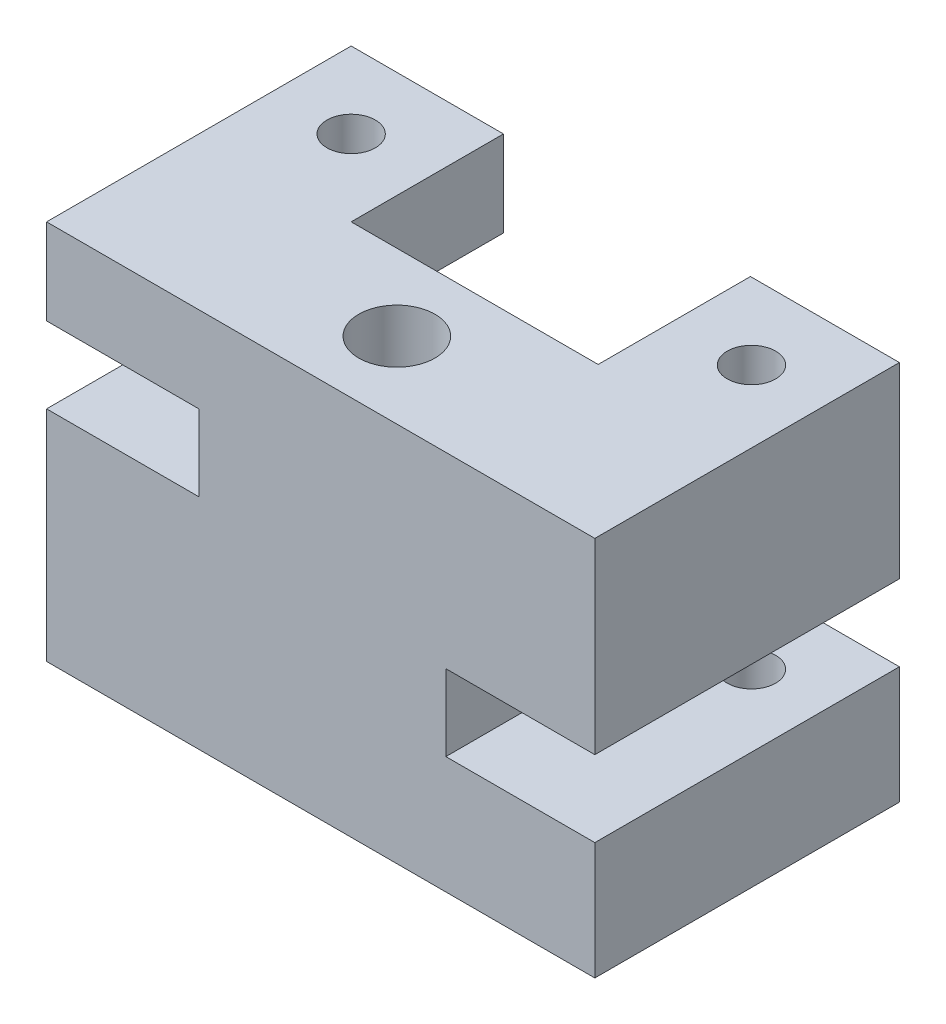
ISO-10303-21;
HEADER;
FILE_DESCRIPTION(('STEP AP214'),'2;1');
FILE_NAME('part.step','',(''),(''),'','','');
FILE_SCHEMA(('AUTOMOTIVE_DESIGN { 1 0 10303 214 1 1 1 1 }'));
ENDSEC;
DATA;
#1=APPLICATION_CONTEXT('core data for automotive mechanical design processes');
#2=APPLICATION_PROTOCOL_DEFINITION('international standard','automotive_design',2000,#1);
#3=PRODUCT_CONTEXT('',#1,'mechanical');
#4=PRODUCT('Part','Part','',(#3));
#5=PRODUCT_RELATED_PRODUCT_CATEGORY('part','',(#4));
#6=PRODUCT_DEFINITION_FORMATION('','',#4);
#7=PRODUCT_DEFINITION_CONTEXT('part definition',#1,'design');
#8=PRODUCT_DEFINITION('design','',#6,#7);
#9=PRODUCT_DEFINITION_SHAPE('','',#8);
#10=(LENGTH_UNIT() NAMED_UNIT(*) SI_UNIT(.MILLI.,.METRE.));
#11=(NAMED_UNIT(*) PLANE_ANGLE_UNIT() SI_UNIT($,.RADIAN.));
#12=(NAMED_UNIT(*) SI_UNIT($,.STERADIAN.) SOLID_ANGLE_UNIT());
#13=UNCERTAINTY_MEASURE_WITH_UNIT(LENGTH_MEASURE(1.E-05),#10,'distance_accuracy_value','');
#14=(GEOMETRIC_REPRESENTATION_CONTEXT(3) GLOBAL_UNCERTAINTY_ASSIGNED_CONTEXT((#13)) GLOBAL_UNIT_ASSIGNED_CONTEXT((#10,
#11,#12)) REPRESENTATION_CONTEXT('',''));
#15=CARTESIAN_POINT('',(0.,0.,0.));
#16=DIRECTION('',(0.,0.,1.));
#17=DIRECTION('',(1.,0.,0.));
#18=AXIS2_PLACEMENT_3D('',#15,#16,#17);
#19=CARTESIAN_POINT('',(0.,0.,0.));
#20=DIRECTION('',(0.,0.,-1.));
#21=DIRECTION('',(-1.,0.,0.));
#22=AXIS2_PLACEMENT_3D('',#19,#20,#21);
#23=PLANE('',#22);
#24=DIRECTION('',(0.,-1.,0.));
#25=VECTOR('',#24,1.);
#26=CARTESIAN_POINT('',(-24.,2.5,0.));
#27=LINE('',#26,#25);
#28=CARTESIAN_POINT('',(-24.,17.5,0.));
#29=VERTEX_POINT('',#28);
#30=CARTESIAN_POINT('',(-24.,2.5,0.));
#31=VERTEX_POINT('',#30);
#32=EDGE_CURVE('E157',#29,#31,#27,.T.);
#33=ORIENTED_EDGE('',*,*,#32,.F.);
#34=DIRECTION('',(0.,-1.,0.));
#35=VECTOR('',#34,1.);
#36=CARTESIAN_POINT('',(-24.,17.5,0.));
#37=LINE('',#36,#35);
#38=CARTESIAN_POINT('',(-24.,34.4017176177199,0.));
#39=VERTEX_POINT('',#38);
#40=EDGE_CURVE('E220',#39,#29,#37,.T.);
#41=ORIENTED_EDGE('',*,*,#40,.F.);
#42=DIRECTION('',(-1.,0.,0.));
#43=VECTOR('',#42,1.);
#44=CARTESIAN_POINT('',(-54.,34.4017176177199,0.));
#45=LINE('',#44,#43);
#46=CARTESIAN_POINT('',(24.6546989048147,34.4017176177199,0.));
#47=VERTEX_POINT('',#46);
#48=EDGE_CURVE('E169',#47,#39,#45,.T.);
#49=ORIENTED_EDGE('',*,*,#48,.F.);
#50=DIRECTION('',(0.,1.,0.));
#51=VECTOR('',#50,1.);
#52=CARTESIAN_POINT('',(24.6546989048147,34.4017176177199,0.));
#53=LINE('',#52,#51);
#54=CARTESIAN_POINT('',(24.6546989048147,-2.5,0.));
#55=VERTEX_POINT('',#54);
#56=EDGE_CURVE('E84',#55,#47,#53,.T.);
#57=ORIENTED_EDGE('',*,*,#56,.F.);
#58=DIRECTION('',(0.,1.,0.));
#59=VECTOR('',#58,1.);
#60=CARTESIAN_POINT('',(24.6546989048147,-2.5,0.));
#61=LINE('',#60,#59);
#62=CARTESIAN_POINT('',(24.6546989048147,-17.5,0.));
#63=VERTEX_POINT('',#62);
#64=EDGE_CURVE('E166',#63,#55,#61,.T.);
#65=ORIENTED_EDGE('',*,*,#64,.F.);
#66=DIRECTION('',(0.,1.,0.));
#67=VECTOR('',#66,1.);
#68=CARTESIAN_POINT('',(24.6546989048147,-17.5,0.));
#69=LINE('',#68,#67);
#70=CARTESIAN_POINT('',(24.6546989048147,-40.5982823822801,0.));
#71=VERTEX_POINT('',#70);
#72=EDGE_CURVE('E248',#71,#63,#69,.T.);
#73=ORIENTED_EDGE('',*,*,#72,.F.);
#74=DIRECTION('',(1.,0.,0.));
#75=VECTOR('',#74,1.);
#76=CARTESIAN_POINT('',(54.,-40.5982823822801,0.));
#77=LINE('',#76,#75);
#78=CARTESIAN_POINT('',(-24.,-40.5982823822801,0.));
#79=VERTEX_POINT('',#78);
#80=EDGE_CURVE('E161',#79,#71,#77,.T.);
#81=ORIENTED_EDGE('',*,*,#80,.F.);
#82=DIRECTION('',(0.,-1.,0.));
#83=VECTOR('',#82,1.);
#84=CARTESIAN_POINT('',(-24.,2.5,0.));
#85=LINE('',#84,#83);
#86=EDGE_CURVE('E59',#31,#79,#85,.T.);
#87=ORIENTED_EDGE('',*,*,#86,.F.);
#88=EDGE_LOOP('',(#33,#41,#49,#57,#65,#73,#81,#87));
#89=FACE_BOUND('',#88,.T.);
#90=ADVANCED_FACE('F43',(#89),#23,.T.);
#91=CARTESIAN_POINT('',(-54.,17.5,30.));
#92=DIRECTION('',(1.,0.,0.));
#93=DIRECTION('',(0.,0.,-1.));
#94=AXIS2_PLACEMENT_3D('',#91,#92,#93);
#95=PLANE('',#94);
#96=DIRECTION('',(0.,0.,-1.));
#97=VECTOR('',#96,1.);
#98=CARTESIAN_POINT('',(-54.,34.4017176177199,30.));
#99=LINE('',#98,#97);
#100=CARTESIAN_POINT('',(-54.,34.4017176177199,30.));
#101=VERTEX_POINT('',#100);
#102=CARTESIAN_POINT('',(-54.,34.4017176177199,-30.));
#103=VERTEX_POINT('',#102);
#104=EDGE_CURVE('E153',#101,#103,#99,.T.);
#105=ORIENTED_EDGE('',*,*,#104,.T.);
#106=DIRECTION('',(0.,1.,0.));
#107=VECTOR('',#106,1.);
#108=CARTESIAN_POINT('',(-54.,17.5,-30.));
#109=LINE('',#108,#107);
#110=CARTESIAN_POINT('',(-54.,17.5,-30.));
#111=VERTEX_POINT('',#110);
#112=EDGE_CURVE('E344',#111,#103,#109,.T.);
#113=ORIENTED_EDGE('',*,*,#112,.F.);
#114=DIRECTION('',(0.,0.,-1.));
#115=VECTOR('',#114,1.);
#116=CARTESIAN_POINT('',(-54.,17.5,30.));
#117=LINE('',#116,#115);
#118=CARTESIAN_POINT('',(-54.,17.5,30.));
#119=VERTEX_POINT('',#118);
#120=EDGE_CURVE('E13',#119,#111,#117,.T.);
#121=ORIENTED_EDGE('',*,*,#120,.F.);
#122=DIRECTION('',(0.,-1.,0.));
#123=VECTOR('',#122,1.);
#124=CARTESIAN_POINT('',(-54.,17.5,30.));
#125=LINE('',#124,#123);
#126=EDGE_CURVE('E173',#101,#119,#125,.T.);
#127=ORIENTED_EDGE('',*,*,#126,.F.);
#128=EDGE_LOOP('',(#105,#113,#121,#127));
#129=FACE_BOUND('',#128,.T.);
#130=ADVANCED_FACE('F45',(#129),#95,.F.);
#131=CARTESIAN_POINT('',(-24.,17.5,30.));
#132=DIRECTION('',(0.,1.,0.));
#133=DIRECTION('',(0.,0.,1.));
#134=AXIS2_PLACEMENT_3D('',#131,#132,#133);
#135=PLANE('',#134);
#136=CARTESIAN_POINT('',(-39.,17.5,-15.));
#137=DIRECTION('',(0.,1.,0.));
#138=DIRECTION('',(0.,0.,1.));
#139=AXIS2_PLACEMENT_3D('',#136,#137,#138);
#140=CIRCLE('',#139,4.7625);
#141=CARTESIAN_POINT('',(-39.,17.5,-10.2375));
#142=VERTEX_POINT('',#141);
#143=EDGE_CURVE('E375',#142,#142,#140,.T.);
#144=ORIENTED_EDGE('',*,*,#143,.T.);
#145=EDGE_LOOP('',(#144));
#146=FACE_BOUND('',#145,.T.);
#147=ORIENTED_EDGE('',*,*,#120,.T.);
#148=DIRECTION('',(-1.,0.,0.));
#149=VECTOR('',#148,1.);
#150=CARTESIAN_POINT('',(-54.,17.5,-30.));
#151=LINE('',#150,#149);
#152=CARTESIAN_POINT('',(-24.,17.5,-30.));
#153=VERTEX_POINT('',#152);
#154=EDGE_CURVE('E341',#153,#111,#151,.T.);
#155=ORIENTED_EDGE('',*,*,#154,.F.);
#156=DIRECTION('',(0.,0.,1.));
#157=VECTOR('',#156,1.);
#158=CARTESIAN_POINT('',(-24.,17.5,-30.));
#159=LINE('',#158,#157);
#160=EDGE_CURVE('E236',#153,#29,#159,.T.);
#161=ORIENTED_EDGE('',*,*,#160,.T.);
#162=DIRECTION('',(0.,0.,-1.));
#163=VECTOR('',#162,1.);
#164=CARTESIAN_POINT('',(-24.,17.5,30.));
#165=LINE('',#164,#163);
#166=CARTESIAN_POINT('',(-24.,17.5,30.));
#167=VERTEX_POINT('',#166);
#168=EDGE_CURVE('E52',#167,#29,#165,.T.);
#169=ORIENTED_EDGE('',*,*,#168,.F.);
#170=DIRECTION('',(1.,0.,0.));
#171=VECTOR('',#170,1.);
#172=CARTESIAN_POINT('',(-24.,17.5,30.));
#173=LINE('',#172,#171);
#174=EDGE_CURVE('E92',#119,#167,#173,.T.);
#175=ORIENTED_EDGE('',*,*,#174,.F.);
#176=EDGE_LOOP('',(#147,#155,#161,#169,#175));
#177=FACE_BOUND('',#176,.T.);
#178=ADVANCED_FACE('F484',(#146,#177),#135,.F.);
#179=CARTESIAN_POINT('',(-24.,2.5,30.));
#180=DIRECTION('',(1.,0.,0.));
#181=DIRECTION('',(0.,1.,0.));
#182=AXIS2_PLACEMENT_3D('',#179,#180,#181);
#183=PLANE('',#182);
#184=ORIENTED_EDGE('',*,*,#32,.T.);
#185=DIRECTION('',(0.,0.,-1.));
#186=VECTOR('',#185,1.);
#187=CARTESIAN_POINT('',(-24.,2.5,30.));
#188=LINE('',#187,#186);
#189=CARTESIAN_POINT('',(-24.,2.5,30.));
#190=VERTEX_POINT('',#189);
#191=EDGE_CURVE('E201',#190,#31,#188,.T.);
#192=ORIENTED_EDGE('',*,*,#191,.F.);
#193=DIRECTION('',(0.,-1.,0.));
#194=VECTOR('',#193,1.);
#195=CARTESIAN_POINT('',(-24.,2.5,30.));
#196=LINE('',#195,#194);
#197=EDGE_CURVE('E213',#167,#190,#196,.T.);
#198=ORIENTED_EDGE('',*,*,#197,.F.);
#199=ORIENTED_EDGE('',*,*,#168,.T.);
#200=EDGE_LOOP('',(#184,#192,#198,#199));
#201=FACE_BOUND('',#200,.T.);
#202=ADVANCED_FACE('F210',(#201),#183,.F.);
#203=CARTESIAN_POINT('',(-54.,2.5,30.));
#204=DIRECTION('',(0.,-1.,0.));
#205=DIRECTION('',(1.,0.,0.));
#206=AXIS2_PLACEMENT_3D('',#203,#204,#205);
#207=PLANE('',#206);
#208=CARTESIAN_POINT('',(-39.,2.5,-15.));
#209=DIRECTION('',(0.,-1.,0.));
#210=DIRECTION('',(1.,0.,0.));
#211=AXIS2_PLACEMENT_3D('',#208,#209,#210);
#212=CIRCLE('',#211,4.7625);
#213=CARTESIAN_POINT('',(-34.2375,2.5,-15.));
#214=VERTEX_POINT('',#213);
#215=EDGE_CURVE('E379',#214,#214,#212,.T.);
#216=ORIENTED_EDGE('',*,*,#215,.T.);
#217=EDGE_LOOP('',(#216));
#218=FACE_BOUND('',#217,.T.);
#219=ORIENTED_EDGE('',*,*,#191,.T.);
#220=DIRECTION('',(0.,0.,1.));
#221=VECTOR('',#220,1.);
#222=CARTESIAN_POINT('',(-24.,2.5,-30.));
#223=LINE('',#222,#221);
#224=CARTESIAN_POINT('',(-24.,2.5,-30.));
#225=VERTEX_POINT('',#224);
#226=EDGE_CURVE('E242',#225,#31,#223,.T.);
#227=ORIENTED_EDGE('',*,*,#226,.F.);
#228=DIRECTION('',(1.,0.,0.));
#229=VECTOR('',#228,1.);
#230=CARTESIAN_POINT('',(-24.,2.5,-30.));
#231=LINE('',#230,#229);
#232=CARTESIAN_POINT('',(-54.,2.5,-30.));
#233=VERTEX_POINT('',#232);
#234=EDGE_CURVE('E240',#233,#225,#231,.T.);
#235=ORIENTED_EDGE('',*,*,#234,.F.);
#236=DIRECTION('',(0.,0.,-1.));
#237=VECTOR('',#236,1.);
#238=CARTESIAN_POINT('',(-54.,2.5,30.));
#239=LINE('',#238,#237);
#240=CARTESIAN_POINT('',(-54.,2.5,30.));
#241=VERTEX_POINT('',#240);
#242=EDGE_CURVE('E197',#241,#233,#239,.T.);
#243=ORIENTED_EDGE('',*,*,#242,.F.);
#244=DIRECTION('',(-1.,0.,0.));
#245=VECTOR('',#244,1.);
#246=CARTESIAN_POINT('',(-54.,2.5,30.));
#247=LINE('',#246,#245);
#248=EDGE_CURVE('E311',#190,#241,#247,.T.);
#249=ORIENTED_EDGE('',*,*,#248,.F.);
#250=EDGE_LOOP('',(#219,#227,#235,#243,#249));
#251=FACE_BOUND('',#250,.T.);
#252=ADVANCED_FACE('F463',(#218,#251),#207,.F.);
#253=CARTESIAN_POINT('',(-54.,-40.5982823822801,30.));
#254=DIRECTION('',(1.,0.,0.));
#255=DIRECTION('',(0.,0.,-1.));
#256=AXIS2_PLACEMENT_3D('',#253,#254,#255);
#257=PLANE('',#256);
#258=ORIENTED_EDGE('',*,*,#242,.T.);
#259=DIRECTION('',(0.,1.,0.));
#260=VECTOR('',#259,1.);
#261=CARTESIAN_POINT('',(-54.,2.5,-30.));
#262=LINE('',#261,#260);
#263=CARTESIAN_POINT('',(-54.,-40.5982823822801,-30.));
#264=VERTEX_POINT('',#263);
#265=EDGE_CURVE('E329',#264,#233,#262,.T.);
#266=ORIENTED_EDGE('',*,*,#265,.F.);
#267=DIRECTION('',(0.,0.,-1.));
#268=VECTOR('',#267,1.);
#269=CARTESIAN_POINT('',(-54.,-40.5982823822801,30.));
#270=LINE('',#269,#268);
#271=CARTESIAN_POINT('',(-54.,-40.5982823822801,30.));
#272=VERTEX_POINT('',#271);
#273=EDGE_CURVE('E193',#272,#264,#270,.T.);
#274=ORIENTED_EDGE('',*,*,#273,.F.);
#275=DIRECTION('',(0.,-1.,0.));
#276=VECTOR('',#275,1.);
#277=CARTESIAN_POINT('',(-54.,-40.5982823822801,30.));
#278=LINE('',#277,#276);
#279=EDGE_CURVE('E314',#241,#272,#278,.T.);
#280=ORIENTED_EDGE('',*,*,#279,.F.);
#281=EDGE_LOOP('',(#258,#266,#274,#280));
#282=FACE_BOUND('',#281,.T.);
#283=ADVANCED_FACE('F460',(#282),#257,.F.);
#284=CARTESIAN_POINT('',(54.,-40.5982823822801,30.));
#285=DIRECTION('',(0.,1.,0.));
#286=DIRECTION('',(0.,0.,1.));
#287=AXIS2_PLACEMENT_3D('',#284,#285,#286);
#288=PLANE('',#287);
#289=CARTESIAN_POINT('',(0.,-40.5982823822801,15.));
#290=DIRECTION('',(0.,1.,0.));
#291=DIRECTION('',(0.,0.,1.));
#292=AXIS2_PLACEMENT_3D('',#289,#290,#291);
#293=CIRCLE('',#292,7.5);
#294=CARTESIAN_POINT('',(0.,-40.5982823822801,22.5));
#295=VERTEX_POINT('',#294);
#296=EDGE_CURVE('E162',#295,#295,#293,.T.);
#297=ORIENTED_EDGE('',*,*,#296,.T.);
#298=EDGE_LOOP('',(#297));
#299=FACE_BOUND('',#298,.T.);
#300=ORIENTED_EDGE('',*,*,#273,.T.);
#301=DIRECTION('',(-1.,0.,0.));
#302=VECTOR('',#301,1.);
#303=CARTESIAN_POINT('',(-24.,-40.5982823822801,-30.));
#304=LINE('',#303,#302);
#305=CARTESIAN_POINT('',(-24.,-40.5982823822801,-30.));
#306=VERTEX_POINT('',#305);
#307=EDGE_CURVE('E233',#306,#264,#304,.T.);
#308=ORIENTED_EDGE('',*,*,#307,.F.);
#309=DIRECTION('',(0.,0.,1.));
#310=VECTOR('',#309,1.);
#311=CARTESIAN_POINT('',(-24.,-40.5982823822801,-30.));
#312=LINE('',#311,#310);
#313=EDGE_CURVE('E245',#306,#79,#312,.T.);
#314=ORIENTED_EDGE('',*,*,#313,.T.);
#315=ORIENTED_EDGE('',*,*,#80,.T.);
#316=DIRECTION('',(0.,0.,1.));
#317=VECTOR('',#316,1.);
#318=CARTESIAN_POINT('',(24.6546989048147,-40.5982823822801,-30.));
#319=LINE('',#318,#317);
#320=CARTESIAN_POINT('',(24.6546989048147,-40.5982823822801,-30.));
#321=VERTEX_POINT('',#320);
#322=EDGE_CURVE('E271',#321,#71,#319,.T.);
#323=ORIENTED_EDGE('',*,*,#322,.F.);
#324=DIRECTION('',(-1.,0.,0.));
#325=VECTOR('',#324,1.);
#326=CARTESIAN_POINT('',(54.,-40.5982823822801,-30.));
#327=LINE('',#326,#325);
#328=CARTESIAN_POINT('',(54.,-40.5982823822801,-30.));
#329=VERTEX_POINT('',#328);
#330=EDGE_CURVE('E253',#329,#321,#327,.T.);
#331=ORIENTED_EDGE('',*,*,#330,.F.);
#332=DIRECTION('',(0.,0.,-1.));
#333=VECTOR('',#332,1.);
#334=CARTESIAN_POINT('',(54.,-40.5982823822801,30.));
#335=LINE('',#334,#333);
#336=CARTESIAN_POINT('',(54.,-40.5982823822801,30.));
#337=VERTEX_POINT('',#336);
#338=EDGE_CURVE('E189',#337,#329,#335,.T.);
#339=ORIENTED_EDGE('',*,*,#338,.F.);
#340=DIRECTION('',(1.,0.,0.));
#341=VECTOR('',#340,1.);
#342=CARTESIAN_POINT('',(54.,-40.5982823822801,30.));
#343=LINE('',#342,#341);
#344=EDGE_CURVE('E317',#272,#337,#343,.T.);
#345=ORIENTED_EDGE('',*,*,#344,.F.);
#346=EDGE_LOOP('',(#300,#308,#314,#315,#323,#331,#339,#345));
#347=FACE_BOUND('',#346,.T.);
#348=ADVANCED_FACE('F446',(#299,#347),#288,.F.);
#349=CARTESIAN_POINT('',(54.,-17.5,30.));
#350=DIRECTION('',(-1.,0.,0.));
#351=DIRECTION('',(0.,-1.,0.));
#352=AXIS2_PLACEMENT_3D('',#349,#350,#351);
#353=PLANE('',#352);
#354=ORIENTED_EDGE('',*,*,#338,.T.);
#355=DIRECTION('',(0.,-1.,0.));
#356=VECTOR('',#355,1.);
#357=CARTESIAN_POINT('',(54.,-17.5,-30.));
#358=LINE('',#357,#356);
#359=CARTESIAN_POINT('',(54.,-17.5,-30.));
#360=VERTEX_POINT('',#359);
#361=EDGE_CURVE('E249',#360,#329,#358,.T.);
#362=ORIENTED_EDGE('',*,*,#361,.F.);
#363=DIRECTION('',(0.,0.,-1.));
#364=VECTOR('',#363,1.);
#365=CARTESIAN_POINT('',(54.,-17.5,30.));
#366=LINE('',#365,#364);
#367=CARTESIAN_POINT('',(54.,-17.5,30.));
#368=VERTEX_POINT('',#367);
#369=EDGE_CURVE('E185',#368,#360,#366,.T.);
#370=ORIENTED_EDGE('',*,*,#369,.F.);
#371=DIRECTION('',(0.,1.,0.));
#372=VECTOR('',#371,1.);
#373=CARTESIAN_POINT('',(54.,-17.5,30.));
#374=LINE('',#373,#372);
#375=EDGE_CURVE('E320',#337,#368,#374,.T.);
#376=ORIENTED_EDGE('',*,*,#375,.F.);
#377=EDGE_LOOP('',(#354,#362,#370,#376));
#378=FACE_BOUND('',#377,.T.);
#379=ADVANCED_FACE('F452',(#378),#353,.F.);
#380=CARTESIAN_POINT('',(24.6546989048147,-17.5,30.));
#381=DIRECTION('',(0.,-1.,0.));
#382=DIRECTION('',(0.,0.,-1.));
#383=AXIS2_PLACEMENT_3D('',#380,#381,#382);
#384=PLANE('',#383);
#385=CARTESIAN_POINT('',(39.8531869876143,-17.5,-15.));
#386=DIRECTION('',(0.,-1.,0.));
#387=DIRECTION('',(0.,0.,-1.));
#388=AXIS2_PLACEMENT_3D('',#385,#386,#387);
#389=CIRCLE('',#388,4.7625);
#390=CARTESIAN_POINT('',(39.8531869876143,-17.5,-19.7625));
#391=VERTEX_POINT('',#390);
#392=EDGE_CURVE('E345',#391,#391,#389,.T.);
#393=ORIENTED_EDGE('',*,*,#392,.T.);
#394=EDGE_LOOP('',(#393));
#395=FACE_BOUND('',#394,.T.);
#396=ORIENTED_EDGE('',*,*,#369,.T.);
#397=DIRECTION('',(1.,0.,0.));
#398=VECTOR('',#397,1.);
#399=CARTESIAN_POINT('',(54.,-17.5,-30.));
#400=LINE('',#399,#398);
#401=CARTESIAN_POINT('',(24.6546989048147,-17.5,-30.));
#402=VERTEX_POINT('',#401);
#403=EDGE_CURVE('E261',#402,#360,#400,.T.);
#404=ORIENTED_EDGE('',*,*,#403,.F.);
#405=DIRECTION('',(0.,0.,1.));
#406=VECTOR('',#405,1.);
#407=CARTESIAN_POINT('',(24.6546989048147,-17.5,-30.));
#408=LINE('',#407,#406);
#409=EDGE_CURVE('E265',#402,#63,#408,.T.);
#410=ORIENTED_EDGE('',*,*,#409,.T.);
#411=DIRECTION('',(0.,0.,-1.));
#412=VECTOR('',#411,1.);
#413=CARTESIAN_POINT('',(24.6546989048147,-17.5,30.));
#414=LINE('',#413,#412);
#415=CARTESIAN_POINT('',(24.6546989048147,-17.5,30.));
#416=VERTEX_POINT('',#415);
#417=EDGE_CURVE('E181',#416,#63,#414,.T.);
#418=ORIENTED_EDGE('',*,*,#417,.F.);
#419=DIRECTION('',(-1.,0.,0.));
#420=VECTOR('',#419,1.);
#421=CARTESIAN_POINT('',(24.6546989048147,-17.5,30.));
#422=LINE('',#421,#420);
#423=EDGE_CURVE('E323',#368,#416,#422,.T.);
#424=ORIENTED_EDGE('',*,*,#423,.F.);
#425=EDGE_LOOP('',(#396,#404,#410,#418,#424));
#426=FACE_BOUND('',#425,.T.);
#427=ADVANCED_FACE('F450',(#395,#426),#384,.F.);
#428=CARTESIAN_POINT('',(24.6546989048147,-2.5,30.));
#429=DIRECTION('',(-1.,0.,0.));
#430=DIRECTION('',(0.,-1.,0.));
#431=AXIS2_PLACEMENT_3D('',#428,#429,#430);
#432=PLANE('',#431);
#433=ORIENTED_EDGE('',*,*,#64,.T.);
#434=DIRECTION('',(0.,0.,-1.));
#435=VECTOR('',#434,1.);
#436=CARTESIAN_POINT('',(24.6546989048147,-2.5,30.));
#437=LINE('',#436,#435);
#438=CARTESIAN_POINT('',(24.6546989048147,-2.5,30.));
#439=VERTEX_POINT('',#438);
#440=EDGE_CURVE('E145',#439,#55,#437,.T.);
#441=ORIENTED_EDGE('',*,*,#440,.F.);
#442=DIRECTION('',(0.,1.,0.));
#443=VECTOR('',#442,1.);
#444=CARTESIAN_POINT('',(24.6546989048147,-2.5,30.));
#445=LINE('',#444,#443);
#446=EDGE_CURVE('E127',#416,#439,#445,.T.);
#447=ORIENTED_EDGE('',*,*,#446,.F.);
#448=ORIENTED_EDGE('',*,*,#417,.T.);
#449=EDGE_LOOP('',(#433,#441,#447,#448));
#450=FACE_BOUND('',#449,.T.);
#451=ADVANCED_FACE('F508',(#450),#432,.F.);
#452=CARTESIAN_POINT('',(54.,-2.5,30.));
#453=DIRECTION('',(0.,1.,0.));
#454=DIRECTION('',(-1.,0.,0.));
#455=AXIS2_PLACEMENT_3D('',#452,#453,#454);
#456=PLANE('',#455);
#457=CARTESIAN_POINT('',(39.8531869876143,-2.5,-15.));
#458=DIRECTION('',(0.,1.,0.));
#459=DIRECTION('',(-1.,0.,0.));
#460=AXIS2_PLACEMENT_3D('',#457,#458,#459);
#461=CIRCLE('',#460,4.7625);
#462=CARTESIAN_POINT('',(35.0906869876143,-2.5,-15.));
#463=VERTEX_POINT('',#462);
#464=EDGE_CURVE('E363',#463,#463,#461,.T.);
#465=ORIENTED_EDGE('',*,*,#464,.T.);
#466=EDGE_LOOP('',(#465));
#467=FACE_BOUND('',#466,.T.);
#468=ORIENTED_EDGE('',*,*,#440,.T.);
#469=DIRECTION('',(0.,0.,1.));
#470=VECTOR('',#469,1.);
#471=CARTESIAN_POINT('',(24.6546989048147,-2.5,-30.));
#472=LINE('',#471,#470);
#473=CARTESIAN_POINT('',(24.6546989048147,-2.5,-30.));
#474=VERTEX_POINT('',#473);
#475=EDGE_CURVE('E294',#474,#55,#472,.T.);
#476=ORIENTED_EDGE('',*,*,#475,.F.);
#477=DIRECTION('',(-1.,0.,0.));
#478=VECTOR('',#477,1.);
#479=CARTESIAN_POINT('',(54.,-2.5,-30.));
#480=LINE('',#479,#478);
#481=CARTESIAN_POINT('',(54.,-2.5,-30.));
#482=VERTEX_POINT('',#481);
#483=EDGE_CURVE('E140',#482,#474,#480,.T.);
#484=ORIENTED_EDGE('',*,*,#483,.F.);
#485=DIRECTION('',(0.,0.,-1.));
#486=VECTOR('',#485,1.);
#487=CARTESIAN_POINT('',(54.,-2.5,30.));
#488=LINE('',#487,#486);
#489=CARTESIAN_POINT('',(54.,-2.5,30.));
#490=VERTEX_POINT('',#489);
#491=EDGE_CURVE('E135',#490,#482,#488,.T.);
#492=ORIENTED_EDGE('',*,*,#491,.F.);
#493=DIRECTION('',(1.,0.,0.));
#494=VECTOR('',#493,1.);
#495=CARTESIAN_POINT('',(54.,-2.5,30.));
#496=LINE('',#495,#494);
#497=EDGE_CURVE('E120',#439,#490,#496,.T.);
#498=ORIENTED_EDGE('',*,*,#497,.F.);
#499=EDGE_LOOP('',(#468,#476,#484,#492,#498));
#500=FACE_BOUND('',#499,.T.);
#501=ADVANCED_FACE('F136',(#467,#500),#456,.F.);
#502=CARTESIAN_POINT('',(54.,34.4017176177199,30.));
#503=DIRECTION('',(-1.,0.,0.));
#504=DIRECTION('',(0.,-1.,0.));
#505=AXIS2_PLACEMENT_3D('',#502,#503,#504);
#506=PLANE('',#505);
#507=ORIENTED_EDGE('',*,*,#491,.T.);
#508=DIRECTION('',(0.,-1.,0.));
#509=VECTOR('',#508,1.);
#510=CARTESIAN_POINT('',(54.,34.4017176177199,-30.));
#511=LINE('',#510,#509);
#512=CARTESIAN_POINT('',(54.,34.4017176177199,-30.));
#513=VERTEX_POINT('',#512);
#514=EDGE_CURVE('E275',#513,#482,#511,.T.);
#515=ORIENTED_EDGE('',*,*,#514,.F.);
#516=DIRECTION('',(0.,0.,-1.));
#517=VECTOR('',#516,1.);
#518=CARTESIAN_POINT('',(54.,34.4017176177199,30.));
#519=LINE('',#518,#517);
#520=CARTESIAN_POINT('',(54.,34.4017176177199,30.));
#521=VERTEX_POINT('',#520);
#522=EDGE_CURVE('E146',#521,#513,#519,.T.);
#523=ORIENTED_EDGE('',*,*,#522,.F.);
#524=DIRECTION('',(0.,1.,0.));
#525=VECTOR('',#524,1.);
#526=CARTESIAN_POINT('',(54.,34.4017176177199,30.));
#527=LINE('',#526,#525);
#528=EDGE_CURVE('E124',#490,#521,#527,.T.);
#529=ORIENTED_EDGE('',*,*,#528,.F.);
#530=EDGE_LOOP('',(#507,#515,#523,#529));
#531=FACE_BOUND('',#530,.T.);
#532=ADVANCED_FACE('F148',(#531),#506,.F.);
#533=CARTESIAN_POINT('',(-54.,34.4017176177199,30.));
#534=DIRECTION('',(0.,-1.,0.));
#535=DIRECTION('',(0.,0.,-1.));
#536=AXIS2_PLACEMENT_3D('',#533,#534,#535);
#537=PLANE('',#536);
#538=CARTESIAN_POINT('',(-39.,34.4017176177199,-15.));
#539=DIRECTION('',(0.,1.,0.));
#540=DIRECTION('',(0.,0.,1.));
#541=AXIS2_PLACEMENT_3D('',#538,#539,#540);
#542=CIRCLE('',#541,4.7625);
#543=CARTESIAN_POINT('',(-39.,34.4017176177199,-10.2375));
#544=VERTEX_POINT('',#543);
#545=EDGE_CURVE('E387',#544,#544,#542,.T.);
#546=ORIENTED_EDGE('',*,*,#545,.F.);
#547=EDGE_LOOP('',(#546));
#548=FACE_BOUND('',#547,.T.);
#549=CARTESIAN_POINT('',(39.8531869876143,34.4017176177199,-15.));
#550=DIRECTION('',(0.,1.,0.));
#551=DIRECTION('',(0.,0.,1.));
#552=AXIS2_PLACEMENT_3D('',#549,#550,#551);
#553=CIRCLE('',#552,4.7625);
#554=CARTESIAN_POINT('',(39.8531869876143,34.4017176177199,-10.2375));
#555=VERTEX_POINT('',#554);
#556=EDGE_CURVE('E371',#555,#555,#553,.T.);
#557=ORIENTED_EDGE('',*,*,#556,.F.);
#558=EDGE_LOOP('',(#557));
#559=FACE_BOUND('',#558,.T.);
#560=CARTESIAN_POINT('',(0.,34.4017176177199,15.));
#561=DIRECTION('',(0.,1.,0.));
#562=DIRECTION('',(0.,0.,1.));
#563=AXIS2_PLACEMENT_3D('',#560,#561,#562);
#564=CIRCLE('',#563,7.5);
#565=CARTESIAN_POINT('',(0.,34.4017176177199,22.5));
#566=VERTEX_POINT('',#565);
#567=EDGE_CURVE('E298',#566,#566,#564,.T.);
#568=ORIENTED_EDGE('',*,*,#567,.F.);
#569=EDGE_LOOP('',(#568));
#570=FACE_BOUND('',#569,.T.);
#571=ORIENTED_EDGE('',*,*,#522,.T.);
#572=DIRECTION('',(1.,0.,0.));
#573=VECTOR('',#572,1.);
#574=CARTESIAN_POINT('',(54.,34.4017176177199,-30.));
#575=LINE('',#574,#573);
#576=CARTESIAN_POINT('',(24.6546989048147,34.4017176177199,-30.));
#577=VERTEX_POINT('',#576);
#578=EDGE_CURVE('E284',#577,#513,#575,.T.);
#579=ORIENTED_EDGE('',*,*,#578,.F.);
#580=DIRECTION('',(0.,0.,1.));
#581=VECTOR('',#580,1.);
#582=CARTESIAN_POINT('',(24.6546989048147,34.4017176177199,-30.));
#583=LINE('',#582,#581);
#584=EDGE_CURVE('E288',#577,#47,#583,.T.);
#585=ORIENTED_EDGE('',*,*,#584,.T.);
#586=ORIENTED_EDGE('',*,*,#48,.T.);
#587=DIRECTION('',(0.,0.,1.));
#588=VECTOR('',#587,1.);
#589=CARTESIAN_POINT('',(-24.,34.4017176177199,-30.));
#590=LINE('',#589,#588);
#591=CARTESIAN_POINT('',(-24.,34.4017176177199,-30.));
#592=VERTEX_POINT('',#591);
#593=EDGE_CURVE('E228',#592,#39,#590,.T.);
#594=ORIENTED_EDGE('',*,*,#593,.F.);
#595=DIRECTION('',(1.,0.,0.));
#596=VECTOR('',#595,1.);
#597=CARTESIAN_POINT('',(-54.,34.4017176177199,-30.));
#598=LINE('',#597,#596);
#599=EDGE_CURVE('E353',#103,#592,#598,.T.);
#600=ORIENTED_EDGE('',*,*,#599,.F.);
#601=ORIENTED_EDGE('',*,*,#104,.F.);
#602=DIRECTION('',(-1.,0.,0.));
#603=VECTOR('',#602,1.);
#604=CARTESIAN_POINT('',(-54.,34.4017176177199,30.));
#605=LINE('',#604,#603);
#606=EDGE_CURVE('E68',#521,#101,#605,.T.);
#607=ORIENTED_EDGE('',*,*,#606,.F.);
#608=EDGE_LOOP('',(#571,#579,#585,#586,#594,#600,#601,#607));
#609=FACE_BOUND('',#608,.T.);
#610=ADVANCED_FACE('F395',(#548,#559,#570,#609),#537,.F.);
#611=CARTESIAN_POINT('',(0.,0.,30.));
#612=DIRECTION('',(0.,0.,-1.));
#613=DIRECTION('',(-1.,0.,0.));
#614=AXIS2_PLACEMENT_3D('',#611,#612,#613);
#615=PLANE('',#614);
#616=ORIENTED_EDGE('',*,*,#126,.T.);
#617=ORIENTED_EDGE('',*,*,#174,.T.);
#618=ORIENTED_EDGE('',*,*,#197,.T.);
#619=ORIENTED_EDGE('',*,*,#248,.T.);
#620=ORIENTED_EDGE('',*,*,#279,.T.);
#621=ORIENTED_EDGE('',*,*,#344,.T.);
#622=ORIENTED_EDGE('',*,*,#375,.T.);
#623=ORIENTED_EDGE('',*,*,#423,.T.);
#624=ORIENTED_EDGE('',*,*,#446,.T.);
#625=ORIENTED_EDGE('',*,*,#497,.T.);
#626=ORIENTED_EDGE('',*,*,#528,.T.);
#627=ORIENTED_EDGE('',*,*,#606,.T.);
#628=EDGE_LOOP('',(#616,#617,#618,#619,#620,#621,#622,#623,#624,#625,#626,#627));
#629=FACE_BOUND('',#628,.T.);
#630=ADVANCED_FACE('F122',(#629),#615,.F.);
#631=CARTESIAN_POINT('',(0.,-40.5982823822801,15.));
#632=DIRECTION('',(0.,1.,0.));
#633=DIRECTION('',(0.,0.,1.));
#634=AXIS2_PLACEMENT_3D('',#631,#632,#633);
#635=CYLINDRICAL_SURFACE('',#634,7.5);
#636=ORIENTED_EDGE('',*,*,#296,.F.);
#637=EDGE_LOOP('',(#636));
#638=FACE_BOUND('',#637,.T.);
#639=ORIENTED_EDGE('',*,*,#567,.T.);
#640=EDGE_LOOP('',(#639));
#641=FACE_BOUND('',#640,.T.);
#642=ADVANCED_FACE('F604',(#638,#641),#635,.F.);
#643=CARTESIAN_POINT('',(24.6546989048147,34.4017176177199,-30.));
#644=DIRECTION('',(1.,0.,0.));
#645=DIRECTION('',(0.,1.,0.));
#646=AXIS2_PLACEMENT_3D('',#643,#644,#645);
#647=PLANE('',#646);
#648=ORIENTED_EDGE('',*,*,#56,.T.);
#649=ORIENTED_EDGE('',*,*,#584,.F.);
#650=DIRECTION('',(0.,1.,0.));
#651=VECTOR('',#650,1.);
#652=CARTESIAN_POINT('',(24.6546989048147,34.4017176177199,-30.));
#653=LINE('',#652,#651);
#654=EDGE_CURVE('E280',#474,#577,#653,.T.);
#655=ORIENTED_EDGE('',*,*,#654,.F.);
#656=ORIENTED_EDGE('',*,*,#475,.T.);
#657=EDGE_LOOP('',(#648,#649,#655,#656));
#658=FACE_BOUND('',#657,.T.);
#659=ADVANCED_FACE('F412',(#658),#647,.F.);
#660=CARTESIAN_POINT('',(0.,0.,-30.));
#661=DIRECTION('',(0.,0.,-1.));
#662=DIRECTION('',(-1.,0.,0.));
#663=AXIS2_PLACEMENT_3D('',#660,#661,#662);
#664=PLANE('',#663);
#665=ORIENTED_EDGE('',*,*,#514,.T.);
#666=ORIENTED_EDGE('',*,*,#483,.T.);
#667=ORIENTED_EDGE('',*,*,#654,.T.);
#668=ORIENTED_EDGE('',*,*,#578,.T.);
#669=EDGE_LOOP('',(#665,#666,#667,#668));
#670=FACE_BOUND('',#669,.T.);
#671=ADVANCED_FACE('F406',(#670),#664,.T.);
#672=CARTESIAN_POINT('',(24.6546989048147,-17.5,-30.));
#673=DIRECTION('',(1.,0.,0.));
#674=DIRECTION('',(0.,0.,-1.));
#675=AXIS2_PLACEMENT_3D('',#672,#673,#674);
#676=PLANE('',#675);
#677=ORIENTED_EDGE('',*,*,#72,.T.);
#678=ORIENTED_EDGE('',*,*,#409,.F.);
#679=DIRECTION('',(0.,1.,0.));
#680=VECTOR('',#679,1.);
#681=CARTESIAN_POINT('',(24.6546989048147,-17.5,-30.));
#682=LINE('',#681,#680);
#683=EDGE_CURVE('E257',#321,#402,#682,.T.);
#684=ORIENTED_EDGE('',*,*,#683,.F.);
#685=ORIENTED_EDGE('',*,*,#322,.T.);
#686=EDGE_LOOP('',(#677,#678,#684,#685));
#687=FACE_BOUND('',#686,.T.);
#688=ADVANCED_FACE('F448',(#687),#676,.F.);
#689=CARTESIAN_POINT('',(0.,0.,-30.));
#690=DIRECTION('',(0.,0.,-1.));
#691=DIRECTION('',(-1.,0.,0.));
#692=AXIS2_PLACEMENT_3D('',#689,#690,#691);
#693=PLANE('',#692);
#694=ORIENTED_EDGE('',*,*,#361,.T.);
#695=ORIENTED_EDGE('',*,*,#330,.T.);
#696=ORIENTED_EDGE('',*,*,#683,.T.);
#697=ORIENTED_EDGE('',*,*,#403,.T.);
#698=EDGE_LOOP('',(#694,#695,#696,#697));
#699=FACE_BOUND('',#698,.T.);
#700=ADVANCED_FACE('F441',(#699),#693,.T.);
#701=CARTESIAN_POINT('',(-24.,2.5,-30.));
#702=DIRECTION('',(-1.,0.,0.));
#703=DIRECTION('',(0.,-1.,0.));
#704=AXIS2_PLACEMENT_3D('',#701,#702,#703);
#705=PLANE('',#704);
#706=ORIENTED_EDGE('',*,*,#86,.T.);
#707=ORIENTED_EDGE('',*,*,#313,.F.);
#708=DIRECTION('',(0.,-1.,0.));
#709=VECTOR('',#708,1.);
#710=CARTESIAN_POINT('',(-24.,2.5,-30.));
#711=LINE('',#710,#709);
#712=EDGE_CURVE('E227',#225,#306,#711,.T.);
#713=ORIENTED_EDGE('',*,*,#712,.F.);
#714=ORIENTED_EDGE('',*,*,#226,.T.);
#715=EDGE_LOOP('',(#706,#707,#713,#714));
#716=FACE_BOUND('',#715,.T.);
#717=ADVANCED_FACE('F465',(#716),#705,.F.);
#718=CARTESIAN_POINT('',(0.,0.,-30.));
#719=DIRECTION('',(0.,0.,-1.));
#720=DIRECTION('',(-1.,0.,0.));
#721=AXIS2_PLACEMENT_3D('',#718,#719,#720);
#722=PLANE('',#721);
#723=ORIENTED_EDGE('',*,*,#712,.T.);
#724=ORIENTED_EDGE('',*,*,#307,.T.);
#725=ORIENTED_EDGE('',*,*,#265,.T.);
#726=ORIENTED_EDGE('',*,*,#234,.T.);
#727=EDGE_LOOP('',(#723,#724,#725,#726));
#728=FACE_BOUND('',#727,.T.);
#729=ADVANCED_FACE('F461',(#728),#722,.T.);
#730=CARTESIAN_POINT('',(-24.,17.5,-30.));
#731=DIRECTION('',(-1.,0.,0.));
#732=DIRECTION('',(0.,0.,1.));
#733=AXIS2_PLACEMENT_3D('',#730,#731,#732);
#734=PLANE('',#733);
#735=ORIENTED_EDGE('',*,*,#40,.T.);
#736=ORIENTED_EDGE('',*,*,#160,.F.);
#737=DIRECTION('',(0.,-1.,0.));
#738=VECTOR('',#737,1.);
#739=CARTESIAN_POINT('',(-24.,17.5,-30.));
#740=LINE('',#739,#738);
#741=EDGE_CURVE('E349',#592,#153,#740,.T.);
#742=ORIENTED_EDGE('',*,*,#741,.F.);
#743=ORIENTED_EDGE('',*,*,#593,.T.);
#744=EDGE_LOOP('',(#735,#736,#742,#743));
#745=FACE_BOUND('',#744,.T.);
#746=ADVANCED_FACE('F486',(#745),#734,.F.);
#747=CARTESIAN_POINT('',(0.,0.,-30.));
#748=DIRECTION('',(0.,0.,-1.));
#749=DIRECTION('',(-1.,0.,0.));
#750=AXIS2_PLACEMENT_3D('',#747,#748,#749);
#751=PLANE('',#750);
#752=ORIENTED_EDGE('',*,*,#112,.T.);
#753=ORIENTED_EDGE('',*,*,#599,.T.);
#754=ORIENTED_EDGE('',*,*,#741,.T.);
#755=ORIENTED_EDGE('',*,*,#154,.T.);
#756=EDGE_LOOP('',(#752,#753,#754,#755));
#757=FACE_BOUND('',#756,.T.);
#758=ADVANCED_FACE('F481',(#757),#751,.T.);
#759=CARTESIAN_POINT('',(39.8531869876143,-50.9703841816037,-15.));
#760=DIRECTION('',(0.,1.,0.));
#761=DIRECTION('',(0.,0.,1.));
#762=AXIS2_PLACEMENT_3D('',#759,#760,#761);
#763=CYLINDRICAL_SURFACE('',#762,4.7625);
#764=ORIENTED_EDGE('',*,*,#556,.T.);
#765=EDGE_LOOP('',(#764));
#766=FACE_BOUND('',#765,.T.);
#767=ORIENTED_EDGE('',*,*,#464,.F.);
#768=EDGE_LOOP('',(#767));
#769=FACE_BOUND('',#768,.T.);
#770=ADVANCED_FACE('F493',(#766,#769),#763,.F.);
#771=CARTESIAN_POINT('',(39.8531869876143,-27.5,-15.));
#772=DIRECTION('',(0.,-1.,0.));
#773=DIRECTION('',(0.,0.,-1.));
#774=AXIS2_PLACEMENT_3D('',#771,#772,#773);
#775=CIRCLE('',#774,4.7625);
#776=CARTESIAN_POINT('',(39.8531869876143,-27.5,-19.7625));
#777=VERTEX_POINT('',#776);
#778=EDGE_CURVE('E367',#777,#777,#775,.F.);
#779=ORIENTED_EDGE('',*,*,#778,.F.);
#780=EDGE_LOOP('',(#779));
#781=FACE_BOUND('',#780,.T.);
#782=ORIENTED_EDGE('',*,*,#392,.F.);
#783=EDGE_LOOP('',(#782));
#784=FACE_BOUND('',#783,.T.);
#785=ADVANCED_FACE('F542',(#781,#784),#763,.F.);
#786=CARTESIAN_POINT('',(24.6546989048147,-27.5,30.));
#787=DIRECTION('',(0.,-1.,0.));
#788=DIRECTION('',(0.,0.,-1.));
#789=AXIS2_PLACEMENT_3D('',#786,#787,#788);
#790=PLANE('',#789);
#791=ORIENTED_EDGE('',*,*,#778,.T.);
#792=EDGE_LOOP('',(#791));
#793=FACE_BOUND('',#792,.T.);
#794=ADVANCED_FACE('F534',(#793),#790,.F.);
#795=CARTESIAN_POINT('',(-39.,-30.9703841816037,-15.));
#796=DIRECTION('',(0.,1.,0.));
#797=DIRECTION('',(0.,0.,1.));
#798=AXIS2_PLACEMENT_3D('',#795,#796,#797);
#799=CYLINDRICAL_SURFACE('',#798,4.7625);
#800=ORIENTED_EDGE('',*,*,#545,.T.);
#801=EDGE_LOOP('',(#800));
#802=FACE_BOUND('',#801,.T.);
#803=ORIENTED_EDGE('',*,*,#143,.F.);
#804=EDGE_LOOP('',(#803));
#805=FACE_BOUND('',#804,.T.);
#806=ADVANCED_FACE('F392',(#802,#805),#799,.F.);
#807=CARTESIAN_POINT('',(-39.,-7.5,-15.));
#808=DIRECTION('',(0.,-1.,0.));
#809=DIRECTION('',(1.,0.,0.));
#810=AXIS2_PLACEMENT_3D('',#807,#808,#809);
#811=CIRCLE('',#810,4.7625);
#812=CARTESIAN_POINT('',(-34.2375,-7.5,-15.));
#813=VERTEX_POINT('',#812);
#814=EDGE_CURVE('E383',#813,#813,#811,.F.);
#815=ORIENTED_EDGE('',*,*,#814,.F.);
#816=EDGE_LOOP('',(#815));
#817=FACE_BOUND('',#816,.T.);
#818=ORIENTED_EDGE('',*,*,#215,.F.);
#819=EDGE_LOOP('',(#818));
#820=FACE_BOUND('',#819,.T.);
#821=ADVANCED_FACE('F533',(#817,#820),#799,.F.);
#822=CARTESIAN_POINT('',(-54.,-7.5,30.));
#823=DIRECTION('',(0.,-1.,0.));
#824=DIRECTION('',(1.,0.,0.));
#825=AXIS2_PLACEMENT_3D('',#822,#823,#824);
#826=PLANE('',#825);
#827=ORIENTED_EDGE('',*,*,#814,.T.);
#828=EDGE_LOOP('',(#827));
#829=FACE_BOUND('',#828,.T.);
#830=ADVANCED_FACE('F540',(#829),#826,.F.);
#831=CLOSED_SHELL('',(#90,#130,#178,#202,#252,#283,#348,#379,#427,#451,#501,#532,#610,#630,#642,
#659,#671,#688,#700,#717,#729,#746,#758,#770,#785,#794,#806,#821,#830));
#832=MANIFOLD_SOLID_BREP('B2',#831);
#833=ADVANCED_BREP_SHAPE_REPRESENTATION('',(#18,#832),#14);
#834=SHAPE_DEFINITION_REPRESENTATION(#9,#833);
ENDSEC;
END-ISO-10303-21;
